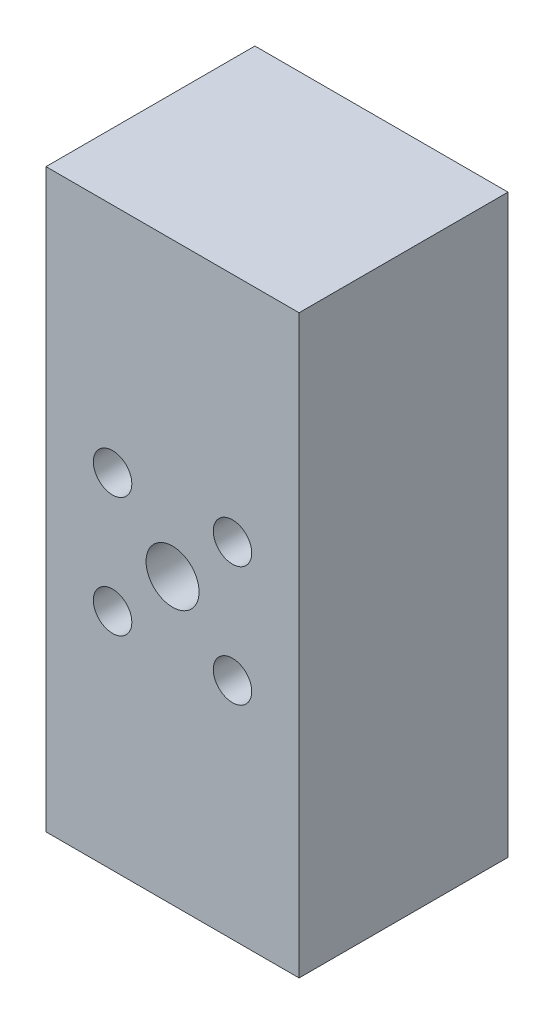
ISO-10303-21;
HEADER;
FILE_DESCRIPTION(('STEP AP214'),'2;1');
FILE_NAME('part.step','',(''),(''),'','','');
FILE_SCHEMA(('AUTOMOTIVE_DESIGN { 1 0 10303 214 1 1 1 1 }'));
ENDSEC;
DATA;
#1=APPLICATION_CONTEXT('core data for automotive mechanical design processes');
#2=APPLICATION_PROTOCOL_DEFINITION('international standard','automotive_design',2000,#1);
#3=PRODUCT_CONTEXT('',#1,'mechanical');
#4=PRODUCT('Part','Part','',(#3));
#5=PRODUCT_RELATED_PRODUCT_CATEGORY('part','',(#4));
#6=PRODUCT_DEFINITION_FORMATION('','',#4);
#7=PRODUCT_DEFINITION_CONTEXT('part definition',#1,'design');
#8=PRODUCT_DEFINITION('design','',#6,#7);
#9=PRODUCT_DEFINITION_SHAPE('','',#8);
#10=(LENGTH_UNIT() NAMED_UNIT(*) SI_UNIT(.MILLI.,.METRE.));
#11=(NAMED_UNIT(*) PLANE_ANGLE_UNIT() SI_UNIT($,.RADIAN.));
#12=(NAMED_UNIT(*) SI_UNIT($,.STERADIAN.) SOLID_ANGLE_UNIT());
#13=UNCERTAINTY_MEASURE_WITH_UNIT(LENGTH_MEASURE(1.E-05),#10,'distance_accuracy_value','');
#14=(GEOMETRIC_REPRESENTATION_CONTEXT(3) GLOBAL_UNCERTAINTY_ASSIGNED_CONTEXT((#13)) GLOBAL_UNIT_ASSIGNED_CONTEXT((#10,
#11,#12)) REPRESENTATION_CONTEXT('',''));
#15=CARTESIAN_POINT('',(0.,0.,0.));
#16=DIRECTION('',(0.,0.,1.));
#17=DIRECTION('',(1.,0.,0.));
#18=AXIS2_PLACEMENT_3D('',#15,#16,#17);
#19=CARTESIAN_POINT('',(23.4999999999754,52.8073925901338,-38.8000000000008));
#20=DIRECTION('',(0.,0.,1.));
#21=DIRECTION('',(1.,0.,0.));
#22=AXIS2_PLACEMENT_3D('',#19,#20,#21);
#23=CYLINDRICAL_SURFACE('',#22,4.92125);
#24=CARTESIAN_POINT('',(23.4999999999754,52.8073925901338,0.));
#25=DIRECTION('',(0.,0.,1.));
#26=DIRECTION('',(1.,0.,0.));
#27=AXIS2_PLACEMENT_3D('',#24,#25,#26);
#28=CIRCLE('',#27,4.92125);
#29=CARTESIAN_POINT('',(28.4212499999754,52.8073925901338,0.));
#30=VERTEX_POINT('',#29);
#31=EDGE_CURVE('E129',#30,#30,#28,.T.);
#32=ORIENTED_EDGE('',*,*,#31,.T.);
#33=EDGE_LOOP('',(#32));
#34=FACE_BOUND('',#33,.T.);
#35=CARTESIAN_POINT('',(23.4999999999754,52.8073925901338,-17.7814999999999));
#36=DIRECTION('',(0.,0.,-1.));
#37=DIRECTION('',(-1.,0.,0.));
#38=AXIS2_PLACEMENT_3D('',#35,#36,#37);
#39=CIRCLE('',#38,4.92125);
#40=CARTESIAN_POINT('',(18.5787499999754,52.8073925901338,-17.7814999999999));
#41=VERTEX_POINT('',#40);
#42=EDGE_CURVE('E42',#41,#41,#39,.F.);
#43=ORIENTED_EDGE('',*,*,#42,.F.);
#44=EDGE_LOOP('',(#43));
#45=FACE_BOUND('',#44,.T.);
#46=ADVANCED_FACE('F38',(#34,#45),#23,.F.);
#47=CARTESIAN_POINT('',(0.,106.9999892,0.));
#48=DIRECTION('',(1.,0.,0.));
#49=DIRECTION('',(0.,0.,-1.));
#50=AXIS2_PLACEMENT_3D('',#47,#48,#49);
#51=PLANE('',#50);
#52=CARTESIAN_POINT('',(0.,20.,-19.4000000000004));
#53=DIRECTION('',(1.,0.,0.));
#54=DIRECTION('',(0.,0.,-1.));
#55=AXIS2_PLACEMENT_3D('',#52,#53,#54);
#56=CIRCLE('',#55,2.);
#57=CARTESIAN_POINT('',(0.,20.,-21.4000000000004));
#58=VERTEX_POINT('',#57);
#59=EDGE_CURVE('E173',#58,#58,#56,.T.);
#60=ORIENTED_EDGE('',*,*,#59,.T.);
#61=EDGE_LOOP('',(#60));
#62=FACE_BOUND('',#61,.T.);
#63=CARTESIAN_POINT('',(0.,79.944,-19.4000000000004));
#64=DIRECTION('',(1.,0.,0.));
#65=DIRECTION('',(0.,0.,-1.));
#66=AXIS2_PLACEMENT_3D('',#63,#64,#65);
#67=CIRCLE('',#66,2.);
#68=CARTESIAN_POINT('',(0.,79.944,-21.4000000000004));
#69=VERTEX_POINT('',#68);
#70=EDGE_CURVE('E167',#69,#69,#67,.T.);
#71=ORIENTED_EDGE('',*,*,#70,.T.);
#72=EDGE_LOOP('',(#71));
#73=FACE_BOUND('',#72,.T.);
#74=DIRECTION('',(0.,0.,1.));
#75=VECTOR('',#74,1.);
#76=CARTESIAN_POINT('',(0.,0.,0.));
#77=LINE('',#76,#75);
#78=CARTESIAN_POINT('',(0.,0.,-38.7999999999999));
#79=VERTEX_POINT('',#78);
#80=CARTESIAN_POINT('',(0.,0.,0.));
#81=VERTEX_POINT('',#80);
#82=EDGE_CURVE('E104',#79,#81,#77,.T.);
#83=ORIENTED_EDGE('',*,*,#82,.T.);
#84=DIRECTION('',(0.,-1.,0.));
#85=VECTOR('',#84,1.);
#86=CARTESIAN_POINT('',(0.,106.9999892,0.));
#87=LINE('',#86,#85);
#88=CARTESIAN_POINT('',(0.,106.9999892,0.));
#89=VERTEX_POINT('',#88);
#90=EDGE_CURVE('E11',#89,#81,#87,.T.);
#91=ORIENTED_EDGE('',*,*,#90,.F.);
#92=DIRECTION('',(0.,0.,1.));
#93=VECTOR('',#92,1.);
#94=CARTESIAN_POINT('',(0.,106.9999892,0.));
#95=LINE('',#94,#93);
#96=CARTESIAN_POINT('',(0.,106.9999892,-38.7999999999999));
#97=VERTEX_POINT('',#96);
#98=EDGE_CURVE('E89',#97,#89,#95,.T.);
#99=ORIENTED_EDGE('',*,*,#98,.F.);
#100=DIRECTION('',(0.,-1.,0.));
#101=VECTOR('',#100,1.);
#102=CARTESIAN_POINT('',(0.,106.9999892,-38.7999999999999));
#103=LINE('',#102,#101);
#104=EDGE_CURVE('E56',#97,#79,#103,.T.);
#105=ORIENTED_EDGE('',*,*,#104,.T.);
#106=EDGE_LOOP('',(#83,#91,#99,#105));
#107=FACE_BOUND('',#106,.T.);
#108=ADVANCED_FACE('F40',(#62,#73,#107),#51,.F.);
#109=CARTESIAN_POINT('',(0.,106.9999892,0.));
#110=DIRECTION('',(0.,0.,-1.));
#111=DIRECTION('',(-1.,0.,0.));
#112=AXIS2_PLACEMENT_3D('',#109,#110,#111);
#113=PLANE('',#112);
#114=CARTESIAN_POINT('',(12.3644824098609,41.671875000008,0.));
#115=DIRECTION('',(0.,0.,1.));
#116=DIRECTION('',(1.,0.,0.));
#117=AXIS2_PLACEMENT_3D('',#114,#115,#116);
#118=CIRCLE('',#117,3.57187499999999);
#119=CARTESIAN_POINT('',(15.9363574098609,41.671875000008,0.));
#120=VERTEX_POINT('',#119);
#121=EDGE_CURVE('E122',#120,#120,#118,.T.);
#122=ORIENTED_EDGE('',*,*,#121,.F.);
#123=EDGE_LOOP('',(#122));
#124=FACE_BOUND('',#123,.T.);
#125=ORIENTED_EDGE('',*,*,#31,.F.);
#126=EDGE_LOOP('',(#125));
#127=FACE_BOUND('',#126,.T.);
#128=CARTESIAN_POINT('',(34.6355175900983,41.6718750000224,0.));
#129=DIRECTION('',(0.,0.,1.));
#130=DIRECTION('',(1.,0.,0.));
#131=AXIS2_PLACEMENT_3D('',#128,#129,#130);
#132=CIRCLE('',#131,3.57187500000001);
#133=CARTESIAN_POINT('',(38.2073925900983,41.6718750000224,0.));
#134=VERTEX_POINT('',#133);
#135=EDGE_CURVE('E132',#134,#134,#132,.T.);
#136=ORIENTED_EDGE('',*,*,#135,.F.);
#137=EDGE_LOOP('',(#136));
#138=FACE_BOUND('',#137,.T.);
#139=CARTESIAN_POINT('',(34.6355175900839,63.9429101802595,0.));
#140=DIRECTION('',(0.,0.,1.));
#141=DIRECTION('',(1.,0.,0.));
#142=AXIS2_PLACEMENT_3D('',#139,#140,#141);
#143=CIRCLE('',#142,3.57187499999999);
#144=CARTESIAN_POINT('',(38.2073925900839,63.9429101802595,0.));
#145=VERTEX_POINT('',#144);
#146=EDGE_CURVE('E138',#145,#145,#143,.T.);
#147=ORIENTED_EDGE('',*,*,#146,.F.);
#148=EDGE_LOOP('',(#147));
#149=FACE_BOUND('',#148,.T.);
#150=CARTESIAN_POINT('',(12.3644824098466,63.9429101802452,0.));
#151=DIRECTION('',(0.,0.,1.));
#152=DIRECTION('',(1.,0.,0.));
#153=AXIS2_PLACEMENT_3D('',#150,#151,#152);
#154=CIRCLE('',#153,3.57187500000001);
#155=CARTESIAN_POINT('',(15.9363574098466,63.9429101802452,0.));
#156=VERTEX_POINT('',#155);
#157=EDGE_CURVE('E116',#156,#156,#154,.T.);
#158=ORIENTED_EDGE('',*,*,#157,.F.);
#159=EDGE_LOOP('',(#158));
#160=FACE_BOUND('',#159,.T.);
#161=DIRECTION('',(1.,0.,0.));
#162=VECTOR('',#161,1.);
#163=CARTESIAN_POINT('',(0.,0.,0.));
#164=LINE('',#163,#162);
#165=CARTESIAN_POINT('',(47.0000000000011,0.,0.));
#166=VERTEX_POINT('',#165);
#167=EDGE_CURVE('E94',#81,#166,#164,.T.);
#168=ORIENTED_EDGE('',*,*,#167,.T.);
#169=DIRECTION('',(0.,-1.,0.));
#170=VECTOR('',#169,1.);
#171=CARTESIAN_POINT('',(47.0000000000011,106.9999892,0.));
#172=LINE('',#171,#170);
#173=CARTESIAN_POINT('',(47.0000000000011,106.9999892,0.));
#174=VERTEX_POINT('',#173);
#175=EDGE_CURVE('E48',#174,#166,#172,.T.);
#176=ORIENTED_EDGE('',*,*,#175,.F.);
#177=DIRECTION('',(1.,0.,0.));
#178=VECTOR('',#177,1.);
#179=CARTESIAN_POINT('',(0.,106.9999892,0.));
#180=LINE('',#179,#178);
#181=EDGE_CURVE('E82',#89,#174,#180,.T.);
#182=ORIENTED_EDGE('',*,*,#181,.F.);
#183=ORIENTED_EDGE('',*,*,#90,.T.);
#184=EDGE_LOOP('',(#168,#176,#182,#183));
#185=FACE_BOUND('',#184,.T.);
#186=ADVANCED_FACE('F93',(#124,#127,#138,#149,#160,#185),#113,.F.);
#187=CARTESIAN_POINT('',(47.0000000000011,106.9999892,0.));
#188=DIRECTION('',(-1.,0.,0.));
#189=DIRECTION('',(0.,0.,1.));
#190=AXIS2_PLACEMENT_3D('',#187,#188,#189);
#191=PLANE('',#190);
#192=DIRECTION('',(0.,0.,-1.));
#193=VECTOR('',#192,1.);
#194=CARTESIAN_POINT('',(47.0000000000011,0.,0.));
#195=LINE('',#194,#193);
#196=CARTESIAN_POINT('',(47.0000000000011,0.,-38.8000000000008));
#197=VERTEX_POINT('',#196);
#198=EDGE_CURVE('E108',#166,#197,#195,.T.);
#199=ORIENTED_EDGE('',*,*,#198,.T.);
#200=DIRECTION('',(0.,-1.,0.));
#201=VECTOR('',#200,1.);
#202=CARTESIAN_POINT('',(47.0000000000011,106.9999892,-38.8000000000008));
#203=LINE('',#202,#201);
#204=CARTESIAN_POINT('',(47.0000000000011,106.9999892,-38.8000000000008));
#205=VERTEX_POINT('',#204);
#206=EDGE_CURVE('E71',#205,#197,#203,.T.);
#207=ORIENTED_EDGE('',*,*,#206,.F.);
#208=DIRECTION('',(0.,0.,-1.));
#209=VECTOR('',#208,1.);
#210=CARTESIAN_POINT('',(47.0000000000011,106.9999892,0.));
#211=LINE('',#210,#209);
#212=EDGE_CURVE('E88',#174,#205,#211,.T.);
#213=ORIENTED_EDGE('',*,*,#212,.F.);
#214=ORIENTED_EDGE('',*,*,#175,.T.);
#215=EDGE_LOOP('',(#199,#207,#213,#214));
#216=FACE_BOUND('',#215,.T.);
#217=ADVANCED_FACE('F98',(#216),#191,.F.);
#218=CARTESIAN_POINT('',(0.,106.9999892,-38.7999999999999));
#219=DIRECTION('',(0.,0.,-1.));
#220=DIRECTION('',(-1.,0.,0.));
#221=AXIS2_PLACEMENT_3D('',#218,#219,#220);
#222=PLANE('',#221);
#223=CARTESIAN_POINT('',(23.4999999999754,52.8073925901338,-38.7999999999999));
#224=DIRECTION('',(0.,0.,-1.));
#225=DIRECTION('',(-1.,0.,0.));
#226=AXIS2_PLACEMENT_3D('',#223,#224,#225);
#227=CIRCLE('',#226,9.525);
#228=CARTESIAN_POINT('',(13.9749999999754,52.8073925901338,-38.7999999999999));
#229=VERTEX_POINT('',#228);
#230=EDGE_CURVE('E178',#229,#229,#227,.T.);
#231=ORIENTED_EDGE('',*,*,#230,.F.);
#232=EDGE_LOOP('',(#231));
#233=FACE_BOUND('',#232,.T.);
#234=CARTESIAN_POINT('',(12.3644824098609,41.671875000008,-38.8000000000008));
#235=DIRECTION('',(0.,0.,1.));
#236=DIRECTION('',(1.,0.,0.));
#237=AXIS2_PLACEMENT_3D('',#234,#235,#236);
#238=CIRCLE('',#237,3.57187499999999);
#239=CARTESIAN_POINT('',(15.9363574098609,41.671875000008,-38.8000000000008));
#240=VERTEX_POINT('',#239);
#241=EDGE_CURVE('E125',#240,#240,#238,.T.);
#242=ORIENTED_EDGE('',*,*,#241,.T.);
#243=EDGE_LOOP('',(#242));
#244=FACE_BOUND('',#243,.T.);
#245=CARTESIAN_POINT('',(34.6355175900983,41.6718750000224,-38.8000000000008));
#246=DIRECTION('',(0.,0.,1.));
#247=DIRECTION('',(1.,0.,0.));
#248=AXIS2_PLACEMENT_3D('',#245,#246,#247);
#249=CIRCLE('',#248,3.57187500000001);
#250=CARTESIAN_POINT('',(38.2073925900983,41.6718750000224,-38.8000000000008));
#251=VERTEX_POINT('',#250);
#252=EDGE_CURVE('E135',#251,#251,#249,.T.);
#253=ORIENTED_EDGE('',*,*,#252,.T.);
#254=EDGE_LOOP('',(#253));
#255=FACE_BOUND('',#254,.T.);
#256=CARTESIAN_POINT('',(34.6355175900839,63.9429101802595,-38.8000000000008));
#257=DIRECTION('',(0.,0.,1.));
#258=DIRECTION('',(1.,0.,0.));
#259=AXIS2_PLACEMENT_3D('',#256,#257,#258);
#260=CIRCLE('',#259,3.57187499999999);
#261=CARTESIAN_POINT('',(38.2073925900839,63.9429101802595,-38.8000000000008));
#262=VERTEX_POINT('',#261);
#263=EDGE_CURVE('E119',#262,#262,#260,.T.);
#264=ORIENTED_EDGE('',*,*,#263,.T.);
#265=EDGE_LOOP('',(#264));
#266=FACE_BOUND('',#265,.T.);
#267=CARTESIAN_POINT('',(12.3644824098466,63.9429101802452,-38.8000000000008));
#268=DIRECTION('',(0.,0.,1.));
#269=DIRECTION('',(1.,0.,0.));
#270=AXIS2_PLACEMENT_3D('',#267,#268,#269);
#271=CIRCLE('',#270,3.57187500000001);
#272=CARTESIAN_POINT('',(15.9363574098466,63.9429101802452,-38.8000000000008));
#273=VERTEX_POINT('',#272);
#274=EDGE_CURVE('E106',#273,#273,#271,.T.);
#275=ORIENTED_EDGE('',*,*,#274,.T.);
#276=EDGE_LOOP('',(#275));
#277=FACE_BOUND('',#276,.T.);
#278=DIRECTION('',(1.,0.,0.));
#279=VECTOR('',#278,1.);
#280=CARTESIAN_POINT('',(0.,0.,-38.7999999999999));
#281=LINE('',#280,#279);
#282=EDGE_CURVE('E110',#79,#197,#281,.T.);
#283=ORIENTED_EDGE('',*,*,#282,.F.);
#284=ORIENTED_EDGE('',*,*,#104,.F.);
#285=DIRECTION('',(1.,0.,0.));
#286=VECTOR('',#285,1.);
#287=CARTESIAN_POINT('',(0.,106.9999892,-38.7999999999999));
#288=LINE('',#287,#286);
#289=EDGE_CURVE('E99',#97,#205,#288,.T.);
#290=ORIENTED_EDGE('',*,*,#289,.T.);
#291=ORIENTED_EDGE('',*,*,#206,.T.);
#292=EDGE_LOOP('',(#283,#284,#290,#291));
#293=FACE_BOUND('',#292,.T.);
#294=ADVANCED_FACE('F214',(#233,#244,#255,#266,#277,#293),#222,.T.);
#295=CARTESIAN_POINT('',(0.,106.9999892,0.));
#296=DIRECTION('',(0.,1.,0.));
#297=DIRECTION('',(0.,0.,1.));
#298=AXIS2_PLACEMENT_3D('',#295,#296,#297);
#299=PLANE('',#298);
#300=ORIENTED_EDGE('',*,*,#98,.T.);
#301=ORIENTED_EDGE('',*,*,#181,.T.);
#302=ORIENTED_EDGE('',*,*,#212,.T.);
#303=ORIENTED_EDGE('',*,*,#289,.F.);
#304=EDGE_LOOP('',(#300,#301,#302,#303));
#305=FACE_BOUND('',#304,.T.);
#306=ADVANCED_FACE('F85',(#305),#299,.T.);
#307=CARTESIAN_POINT('',(0.,0.,0.));
#308=DIRECTION('',(0.,1.,0.));
#309=DIRECTION('',(0.,0.,1.));
#310=AXIS2_PLACEMENT_3D('',#307,#308,#309);
#311=PLANE('',#310);
#312=CARTESIAN_POINT('',(42.5,0.,-34.3999999999999));
#313=DIRECTION('',(0.,1.,0.));
#314=DIRECTION('',(0.,0.,1.));
#315=AXIS2_PLACEMENT_3D('',#312,#313,#314);
#316=CIRCLE('',#315,2.5);
#317=CARTESIAN_POINT('',(42.5,0.,-31.8999999999999));
#318=VERTEX_POINT('',#317);
#319=EDGE_CURVE('E149',#318,#318,#316,.T.);
#320=ORIENTED_EDGE('',*,*,#319,.T.);
#321=EDGE_LOOP('',(#320));
#322=FACE_BOUND('',#321,.T.);
#323=CARTESIAN_POINT('',(42.5,0.,-4.3999999999999));
#324=DIRECTION('',(0.,1.,0.));
#325=DIRECTION('',(0.,0.,1.));
#326=AXIS2_PLACEMENT_3D('',#323,#324,#325);
#327=CIRCLE('',#326,2.50000000000001);
#328=CARTESIAN_POINT('',(42.5,0.,-1.89999999999989));
#329=VERTEX_POINT('',#328);
#330=EDGE_CURVE('E156',#329,#329,#327,.T.);
#331=ORIENTED_EDGE('',*,*,#330,.T.);
#332=EDGE_LOOP('',(#331));
#333=FACE_BOUND('',#332,.T.);
#334=CARTESIAN_POINT('',(4.5,0.,-4.39999999999989));
#335=DIRECTION('',(0.,1.,0.));
#336=DIRECTION('',(0.,0.,1.));
#337=AXIS2_PLACEMENT_3D('',#334,#335,#336);
#338=CIRCLE('',#337,2.5);
#339=CARTESIAN_POINT('',(4.5,0.,-1.89999999999989));
#340=VERTEX_POINT('',#339);
#341=EDGE_CURVE('E162',#340,#340,#338,.T.);
#342=ORIENTED_EDGE('',*,*,#341,.T.);
#343=EDGE_LOOP('',(#342));
#344=FACE_BOUND('',#343,.T.);
#345=CARTESIAN_POINT('',(4.49999999999999,0.,-34.3999999999999));
#346=DIRECTION('',(0.,1.,0.));
#347=DIRECTION('',(0.,0.,1.));
#348=AXIS2_PLACEMENT_3D('',#345,#346,#347);
#349=CIRCLE('',#348,2.627);
#350=CARTESIAN_POINT('',(4.49999999999999,0.,-31.7729999999999));
#351=VERTEX_POINT('',#350);
#352=EDGE_CURVE('E143',#351,#351,#349,.T.);
#353=ORIENTED_EDGE('',*,*,#352,.T.);
#354=EDGE_LOOP('',(#353));
#355=FACE_BOUND('',#354,.T.);
#356=ORIENTED_EDGE('',*,*,#82,.F.);
#357=ORIENTED_EDGE('',*,*,#282,.T.);
#358=ORIENTED_EDGE('',*,*,#198,.F.);
#359=ORIENTED_EDGE('',*,*,#167,.F.);
#360=EDGE_LOOP('',(#356,#357,#358,#359));
#361=FACE_BOUND('',#360,.T.);
#362=ADVANCED_FACE('F210',(#322,#333,#344,#355,#361),#311,.F.);
#363=CARTESIAN_POINT('',(12.3644824098466,63.9429101802452,-38.8000000000008));
#364=DIRECTION('',(0.,0.,1.));
#365=DIRECTION('',(1.,0.,0.));
#366=AXIS2_PLACEMENT_3D('',#363,#364,#365);
#367=CYLINDRICAL_SURFACE('',#366,3.57187500000001);
#368=ORIENTED_EDGE('',*,*,#274,.F.);
#369=EDGE_LOOP('',(#368));
#370=FACE_BOUND('',#369,.T.);
#371=ORIENTED_EDGE('',*,*,#157,.T.);
#372=EDGE_LOOP('',(#371));
#373=FACE_BOUND('',#372,.T.);
#374=ADVANCED_FACE('F206',(#370,#373),#367,.F.);
#375=CARTESIAN_POINT('',(34.6355175900839,63.9429101802595,-38.8000000000008));
#376=DIRECTION('',(0.,0.,1.));
#377=DIRECTION('',(1.,0.,0.));
#378=AXIS2_PLACEMENT_3D('',#375,#376,#377);
#379=CYLINDRICAL_SURFACE('',#378,3.57187499999999);
#380=ORIENTED_EDGE('',*,*,#263,.F.);
#381=EDGE_LOOP('',(#380));
#382=FACE_BOUND('',#381,.T.);
#383=ORIENTED_EDGE('',*,*,#146,.T.);
#384=EDGE_LOOP('',(#383));
#385=FACE_BOUND('',#384,.T.);
#386=ADVANCED_FACE('F209',(#382,#385),#379,.F.);
#387=CARTESIAN_POINT('',(34.6355175900983,41.6718750000224,-38.8000000000008));
#388=DIRECTION('',(0.,0.,1.));
#389=DIRECTION('',(1.,0.,0.));
#390=AXIS2_PLACEMENT_3D('',#387,#388,#389);
#391=CYLINDRICAL_SURFACE('',#390,3.57187500000001);
#392=ORIENTED_EDGE('',*,*,#252,.F.);
#393=EDGE_LOOP('',(#392));
#394=FACE_BOUND('',#393,.T.);
#395=ORIENTED_EDGE('',*,*,#135,.T.);
#396=EDGE_LOOP('',(#395));
#397=FACE_BOUND('',#396,.T.);
#398=ADVANCED_FACE('F199',(#394,#397),#391,.F.);
#399=CARTESIAN_POINT('',(12.3644824098609,41.671875000008,-38.8000000000008));
#400=DIRECTION('',(0.,0.,1.));
#401=DIRECTION('',(1.,0.,0.));
#402=AXIS2_PLACEMENT_3D('',#399,#400,#401);
#403=CYLINDRICAL_SURFACE('',#402,3.57187499999999);
#404=ORIENTED_EDGE('',*,*,#241,.F.);
#405=EDGE_LOOP('',(#404));
#406=FACE_BOUND('',#405,.T.);
#407=ORIENTED_EDGE('',*,*,#121,.T.);
#408=EDGE_LOOP('',(#407));
#409=FACE_BOUND('',#408,.T.);
#410=ADVANCED_FACE('F201',(#406,#409),#403,.F.);
#411=CARTESIAN_POINT('',(4.49999999999999,38.1,-34.3999999999999));
#412=DIRECTION('',(0.,-1.,0.));
#413=DIRECTION('',(0.,0.,-1.));
#414=AXIS2_PLACEMENT_3D('',#411,#412,#413);
#415=CYLINDRICAL_SURFACE('',#414,2.627);
#416=CARTESIAN_POINT('',(4.49999999999999,38.1,-34.3999999999999));
#417=DIRECTION('',(0.,1.,0.));
#418=DIRECTION('',(0.,0.,1.));
#419=AXIS2_PLACEMENT_3D('',#416,#417,#418);
#420=CIRCLE('',#419,2.627);
#421=CARTESIAN_POINT('',(4.49999999999999,38.1,-31.7729999999999));
#422=VERTEX_POINT('',#421);
#423=EDGE_CURVE('E126',#422,#422,#420,.T.);
#424=ORIENTED_EDGE('',*,*,#423,.T.);
#425=EDGE_LOOP('',(#424));
#426=FACE_BOUND('',#425,.T.);
#427=ORIENTED_EDGE('',*,*,#352,.F.);
#428=EDGE_LOOP('',(#427));
#429=FACE_BOUND('',#428,.T.);
#430=ADVANCED_FACE('F204',(#426,#429),#415,.F.);
#431=CARTESIAN_POINT('',(0.,38.1,0.));
#432=DIRECTION('',(0.,1.,0.));
#433=DIRECTION('',(0.,0.,1.));
#434=AXIS2_PLACEMENT_3D('',#431,#432,#433);
#435=PLANE('',#434);
#436=ORIENTED_EDGE('',*,*,#423,.F.);
#437=EDGE_LOOP('',(#436));
#438=FACE_BOUND('',#437,.T.);
#439=ADVANCED_FACE('F247',(#438),#435,.F.);
#440=CARTESIAN_POINT('',(4.5,38.1,-4.39999999999989));
#441=DIRECTION('',(0.,-1.,0.));
#442=DIRECTION('',(0.,0.,-1.));
#443=AXIS2_PLACEMENT_3D('',#440,#441,#442);
#444=CYLINDRICAL_SURFACE('',#443,2.5);
#445=CARTESIAN_POINT('',(4.5,38.1,-4.39999999999989));
#446=DIRECTION('',(0.,1.,0.));
#447=DIRECTION('',(0.,0.,1.));
#448=AXIS2_PLACEMENT_3D('',#445,#446,#447);
#449=CIRCLE('',#448,2.5);
#450=CARTESIAN_POINT('',(4.5,38.1,-1.89999999999989));
#451=VERTEX_POINT('',#450);
#452=EDGE_CURVE('E146',#451,#451,#449,.T.);
#453=ORIENTED_EDGE('',*,*,#452,.T.);
#454=EDGE_LOOP('',(#453));
#455=FACE_BOUND('',#454,.T.);
#456=ORIENTED_EDGE('',*,*,#341,.F.);
#457=EDGE_LOOP('',(#456));
#458=FACE_BOUND('',#457,.T.);
#459=ADVANCED_FACE('F251',(#455,#458),#444,.F.);
#460=CARTESIAN_POINT('',(0.,38.1,0.));
#461=DIRECTION('',(0.,1.,0.));
#462=DIRECTION('',(0.,0.,1.));
#463=AXIS2_PLACEMENT_3D('',#460,#461,#462);
#464=PLANE('',#463);
#465=ORIENTED_EDGE('',*,*,#452,.F.);
#466=EDGE_LOOP('',(#465));
#467=FACE_BOUND('',#466,.T.);
#468=ADVANCED_FACE('F266',(#467),#464,.F.);
#469=CARTESIAN_POINT('',(42.5,38.1,-4.3999999999999));
#470=DIRECTION('',(0.,-1.,0.));
#471=DIRECTION('',(0.,0.,-1.));
#472=AXIS2_PLACEMENT_3D('',#469,#470,#471);
#473=CYLINDRICAL_SURFACE('',#472,2.50000000000001);
#474=CARTESIAN_POINT('',(42.5,38.1,-4.3999999999999));
#475=DIRECTION('',(0.,1.,0.));
#476=DIRECTION('',(0.,0.,1.));
#477=AXIS2_PLACEMENT_3D('',#474,#475,#476);
#478=CIRCLE('',#477,2.50000000000001);
#479=CARTESIAN_POINT('',(42.5,38.1,-1.89999999999989));
#480=VERTEX_POINT('',#479);
#481=EDGE_CURVE('E159',#480,#480,#478,.T.);
#482=ORIENTED_EDGE('',*,*,#481,.T.);
#483=EDGE_LOOP('',(#482));
#484=FACE_BOUND('',#483,.T.);
#485=ORIENTED_EDGE('',*,*,#330,.F.);
#486=EDGE_LOOP('',(#485));
#487=FACE_BOUND('',#486,.T.);
#488=ADVANCED_FACE('F263',(#484,#487),#473,.F.);
#489=CARTESIAN_POINT('',(0.,38.1,0.));
#490=DIRECTION('',(0.,1.,0.));
#491=DIRECTION('',(0.,0.,1.));
#492=AXIS2_PLACEMENT_3D('',#489,#490,#491);
#493=PLANE('',#492);
#494=ORIENTED_EDGE('',*,*,#481,.F.);
#495=EDGE_LOOP('',(#494));
#496=FACE_BOUND('',#495,.T.);
#497=ADVANCED_FACE('F257',(#496),#493,.F.);
#498=CARTESIAN_POINT('',(42.5,38.1,-34.3999999999999));
#499=DIRECTION('',(0.,-1.,0.));
#500=DIRECTION('',(0.,0.,-1.));
#501=AXIS2_PLACEMENT_3D('',#498,#499,#500);
#502=CYLINDRICAL_SURFACE('',#501,2.5);
#503=CARTESIAN_POINT('',(42.5,38.1,-34.3999999999999));
#504=DIRECTION('',(0.,1.,0.));
#505=DIRECTION('',(0.,0.,1.));
#506=AXIS2_PLACEMENT_3D('',#503,#504,#505);
#507=CIRCLE('',#506,2.5);
#508=CARTESIAN_POINT('',(42.5,38.1,-31.8999999999999));
#509=VERTEX_POINT('',#508);
#510=EDGE_CURVE('E152',#509,#509,#507,.T.);
#511=ORIENTED_EDGE('',*,*,#510,.T.);
#512=EDGE_LOOP('',(#511));
#513=FACE_BOUND('',#512,.T.);
#514=ORIENTED_EDGE('',*,*,#319,.F.);
#515=EDGE_LOOP('',(#514));
#516=FACE_BOUND('',#515,.T.);
#517=ADVANCED_FACE('F253',(#513,#516),#502,.F.);
#518=CARTESIAN_POINT('',(0.,38.1,0.));
#519=DIRECTION('',(0.,1.,0.));
#520=DIRECTION('',(0.,0.,1.));
#521=AXIS2_PLACEMENT_3D('',#518,#519,#520);
#522=PLANE('',#521);
#523=ORIENTED_EDGE('',*,*,#510,.F.);
#524=EDGE_LOOP('',(#523));
#525=FACE_BOUND('',#524,.T.);
#526=ADVANCED_FACE('F256',(#525),#522,.F.);
#527=CARTESIAN_POINT('',(25.4,79.944,-19.4000000000004));
#528=DIRECTION('',(-1.,0.,0.));
#529=DIRECTION('',(0.,0.,1.));
#530=AXIS2_PLACEMENT_3D('',#527,#528,#529);
#531=CYLINDRICAL_SURFACE('',#530,2.);
#532=CARTESIAN_POINT('',(25.4,79.944,-19.4000000000004));
#533=DIRECTION('',(1.,0.,0.));
#534=DIRECTION('',(0.,0.,-1.));
#535=AXIS2_PLACEMENT_3D('',#532,#533,#534);
#536=CIRCLE('',#535,2.);
#537=CARTESIAN_POINT('',(25.4,79.944,-21.4000000000004));
#538=VERTEX_POINT('',#537);
#539=EDGE_CURVE('E170',#538,#538,#536,.T.);
#540=ORIENTED_EDGE('',*,*,#539,.T.);
#541=EDGE_LOOP('',(#540));
#542=FACE_BOUND('',#541,.T.);
#543=ORIENTED_EDGE('',*,*,#70,.F.);
#544=EDGE_LOOP('',(#543));
#545=FACE_BOUND('',#544,.T.);
#546=ADVANCED_FACE('F261',(#542,#545),#531,.F.);
#547=CARTESIAN_POINT('',(25.4,79.944,-19.4000000000004));
#548=DIRECTION('',(1.,0.,0.));
#549=DIRECTION('',(0.,0.,-1.));
#550=AXIS2_PLACEMENT_3D('',#547,#548,#549);
#551=PLANE('',#550);
#552=ORIENTED_EDGE('',*,*,#539,.F.);
#553=EDGE_LOOP('',(#552));
#554=FACE_BOUND('',#553,.T.);
#555=ADVANCED_FACE('F279',(#554),#551,.F.);
#556=CARTESIAN_POINT('',(25.4,20.,-19.4000000000004));
#557=DIRECTION('',(-1.,0.,0.));
#558=DIRECTION('',(0.,0.,1.));
#559=AXIS2_PLACEMENT_3D('',#556,#557,#558);
#560=CYLINDRICAL_SURFACE('',#559,2.);
#561=CARTESIAN_POINT('',(25.4,20.,-19.4000000000004));
#562=DIRECTION('',(1.,0.,0.));
#563=DIRECTION('',(0.,0.,-1.));
#564=AXIS2_PLACEMENT_3D('',#561,#562,#563);
#565=CIRCLE('',#564,2.);
#566=CARTESIAN_POINT('',(25.4,20.,-21.4000000000004));
#567=VERTEX_POINT('',#566);
#568=EDGE_CURVE('E153',#567,#567,#565,.T.);
#569=ORIENTED_EDGE('',*,*,#568,.T.);
#570=EDGE_LOOP('',(#569));
#571=FACE_BOUND('',#570,.T.);
#572=ORIENTED_EDGE('',*,*,#59,.F.);
#573=EDGE_LOOP('',(#572));
#574=FACE_BOUND('',#573,.T.);
#575=ADVANCED_FACE('F283',(#571,#574),#560,.F.);
#576=CARTESIAN_POINT('',(25.4,20.,-19.4000000000004));
#577=DIRECTION('',(1.,0.,0.));
#578=DIRECTION('',(0.,0.,-1.));
#579=AXIS2_PLACEMENT_3D('',#576,#577,#578);
#580=PLANE('',#579);
#581=ORIENTED_EDGE('',*,*,#568,.F.);
#582=EDGE_LOOP('',(#581));
#583=FACE_BOUND('',#582,.T.);
#584=ADVANCED_FACE('F287',(#583),#580,.F.);
#585=CARTESIAN_POINT('',(23.4999999999754,52.8073925901338,-17.7814999999999));
#586=DIRECTION('',(0.,0.,-1.));
#587=DIRECTION('',(-1.,0.,0.));
#588=AXIS2_PLACEMENT_3D('',#585,#586,#587);
#589=PLANE('',#588);
#590=CARTESIAN_POINT('',(23.4999999999754,52.8073925901338,-17.7814999999999));
#591=DIRECTION('',(0.,0.,-1.));
#592=DIRECTION('',(-1.,0.,0.));
#593=AXIS2_PLACEMENT_3D('',#590,#591,#592);
#594=CIRCLE('',#593,9.525);
#595=CARTESIAN_POINT('',(13.9749999999754,52.8073925901338,-17.7814999999999));
#596=VERTEX_POINT('',#595);
#597=EDGE_CURVE('E181',#596,#596,#594,.T.);
#598=ORIENTED_EDGE('',*,*,#597,.T.);
#599=EDGE_LOOP('',(#598));
#600=FACE_BOUND('',#599,.T.);
#601=ORIENTED_EDGE('',*,*,#42,.T.);
#602=EDGE_LOOP('',(#601));
#603=FACE_BOUND('',#602,.T.);
#604=ADVANCED_FACE('F188',(#600,#603),#589,.T.);
#605=CARTESIAN_POINT('',(23.4999999999754,52.8073925901338,-17.7814999999999));
#606=DIRECTION('',(0.,0.,-1.));
#607=DIRECTION('',(-1.,0.,0.));
#608=AXIS2_PLACEMENT_3D('',#605,#606,#607);
#609=CYLINDRICAL_SURFACE('',#608,9.525);
#610=ORIENTED_EDGE('',*,*,#597,.F.);
#611=EDGE_LOOP('',(#610));
#612=FACE_BOUND('',#611,.T.);
#613=ORIENTED_EDGE('',*,*,#230,.T.);
#614=EDGE_LOOP('',(#613));
#615=FACE_BOUND('',#614,.T.);
#616=ADVANCED_FACE('F292',(#612,#615),#609,.F.);
#617=CLOSED_SHELL('',(#46,#108,#186,#217,#294,#306,#362,#374,#386,#398,#410,#430,#439,#459,#468,
#488,#497,#517,#526,#546,#555,#575,#584,#604,#616));
#618=MANIFOLD_SOLID_BREP('B2',#617);
#619=ADVANCED_BREP_SHAPE_REPRESENTATION('',(#18,#618),#14);
#620=SHAPE_DEFINITION_REPRESENTATION(#9,#619);
ENDSEC;
END-ISO-10303-21;
